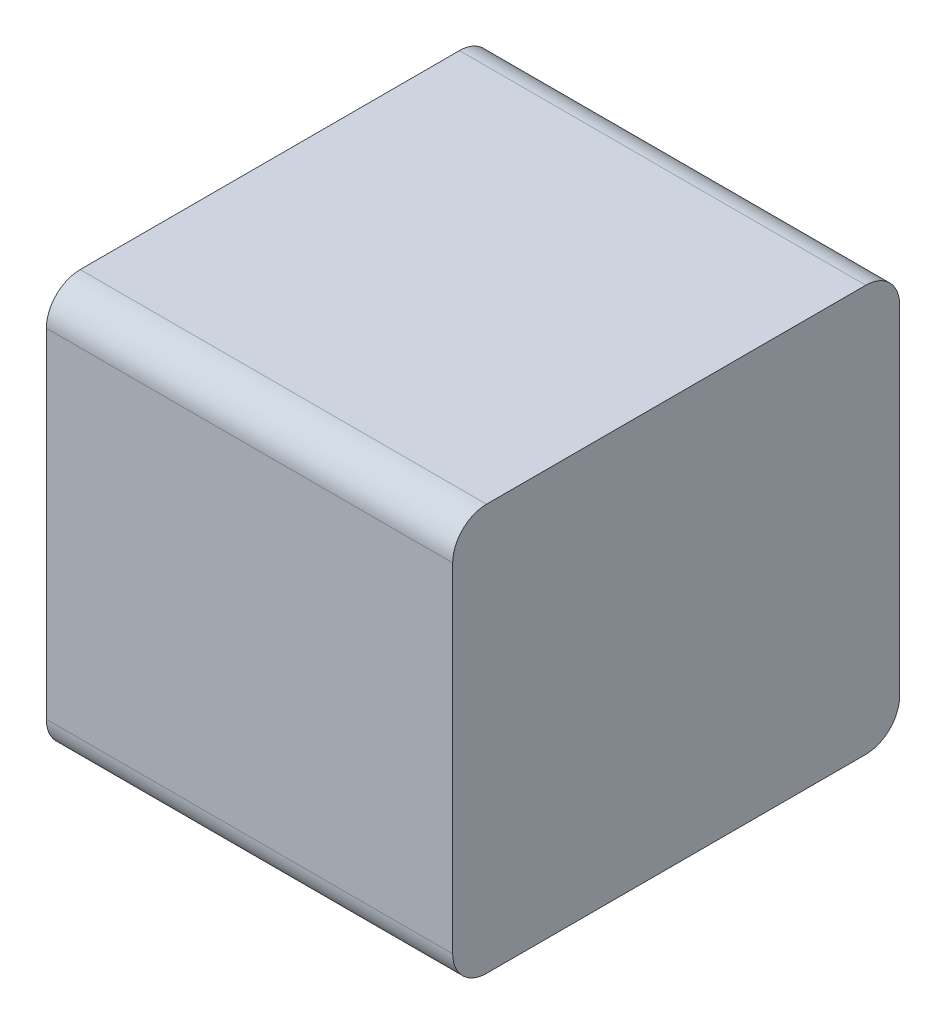
ISO-10303-21;
HEADER;
FILE_DESCRIPTION(('STEP AP214'),'2;1');
FILE_NAME('part.step','',(''),(''),'','','');
FILE_SCHEMA(('AUTOMOTIVE_DESIGN { 1 0 10303 214 1 1 1 1 }'));
ENDSEC;
DATA;
#1=APPLICATION_CONTEXT('core data for automotive mechanical design processes');
#2=APPLICATION_PROTOCOL_DEFINITION('international standard','automotive_design',2000,#1);
#3=PRODUCT_CONTEXT('',#1,'mechanical');
#4=PRODUCT('Part','Part','',(#3));
#5=PRODUCT_RELATED_PRODUCT_CATEGORY('part','',(#4));
#6=PRODUCT_DEFINITION_FORMATION('','',#4);
#7=PRODUCT_DEFINITION_CONTEXT('part definition',#1,'design');
#8=PRODUCT_DEFINITION('design','',#6,#7);
#9=PRODUCT_DEFINITION_SHAPE('','',#8);
#10=(LENGTH_UNIT() NAMED_UNIT(*) SI_UNIT(.MILLI.,.METRE.));
#11=(NAMED_UNIT(*) PLANE_ANGLE_UNIT() SI_UNIT($,.RADIAN.));
#12=(NAMED_UNIT(*) SI_UNIT($,.STERADIAN.) SOLID_ANGLE_UNIT());
#13=UNCERTAINTY_MEASURE_WITH_UNIT(LENGTH_MEASURE(1.E-05),#10,'distance_accuracy_value','');
#14=(GEOMETRIC_REPRESENTATION_CONTEXT(3) GLOBAL_UNCERTAINTY_ASSIGNED_CONTEXT((#13)) GLOBAL_UNIT_ASSIGNED_CONTEXT((#10,
#11,#12)) REPRESENTATION_CONTEXT('',''));
#15=CARTESIAN_POINT('',(0.,0.,0.));
#16=DIRECTION('',(0.,0.,1.));
#17=DIRECTION('',(1.,0.,0.));
#18=AXIS2_PLACEMENT_3D('',#15,#16,#17);
#19=CARTESIAN_POINT('',(0.15,0.,0.165));
#20=DIRECTION('',(1.,0.,0.));
#21=DIRECTION('',(0.,0.,-1.));
#22=AXIS2_PLACEMENT_3D('',#19,#20,#21);
#23=PLANE('',#22);
#24=CARTESIAN_POINT('',(0.15,-0.125,0.025));
#25=DIRECTION('',(1.,0.,0.));
#26=DIRECTION('',(0.,-1.,0.));
#27=AXIS2_PLACEMENT_3D('',#24,#25,#26);
#28=CIRCLE('',#27,0.025);
#29=CARTESIAN_POINT('',(0.15,-0.15,0.025));
#30=VERTEX_POINT('',#29);
#31=CARTESIAN_POINT('',(0.15,-0.125,0.));
#32=VERTEX_POINT('',#31);
#33=EDGE_CURVE('E11',#30,#32,#28,.T.);
#34=ORIENTED_EDGE('',*,*,#33,.T.);
#35=DIRECTION('',(0.,1.,0.));
#36=VECTOR('',#35,1.);
#37=CARTESIAN_POINT('',(0.15,-0.125,0.));
#38=LINE('',#37,#36);
#39=CARTESIAN_POINT('',(0.15,0.125,0.));
#40=VERTEX_POINT('',#39);
#41=EDGE_CURVE('E24',#32,#40,#38,.T.);
#42=ORIENTED_EDGE('',*,*,#41,.T.);
#43=CARTESIAN_POINT('',(0.15,0.125,0.025));
#44=DIRECTION('',(1.,0.,0.));
#45=DIRECTION('',(0.,0.,-1.));
#46=AXIS2_PLACEMENT_3D('',#43,#44,#45);
#47=CIRCLE('',#46,0.025);
#48=CARTESIAN_POINT('',(0.15,0.15,0.025));
#49=VERTEX_POINT('',#48);
#50=EDGE_CURVE('E141',#40,#49,#47,.T.);
#51=ORIENTED_EDGE('',*,*,#50,.T.);
#52=DIRECTION('',(0.,0.,1.));
#53=VECTOR('',#52,1.);
#54=CARTESIAN_POINT('',(0.15,0.15,0.025));
#55=LINE('',#54,#53);
#56=CARTESIAN_POINT('',(0.15,0.15,0.305));
#57=VERTEX_POINT('',#56);
#58=EDGE_CURVE('E139',#49,#57,#55,.T.);
#59=ORIENTED_EDGE('',*,*,#58,.T.);
#60=CARTESIAN_POINT('',(0.15,0.125,0.305));
#61=DIRECTION('',(1.,0.,0.));
#62=DIRECTION('',(0.,1.,0.));
#63=AXIS2_PLACEMENT_3D('',#60,#61,#62);
#64=CIRCLE('',#63,0.025);
#65=CARTESIAN_POINT('',(0.15,0.125,0.33));
#66=VERTEX_POINT('',#65);
#67=EDGE_CURVE('E137',#57,#66,#64,.T.);
#68=ORIENTED_EDGE('',*,*,#67,.T.);
#69=DIRECTION('',(0.,-1.,0.));
#70=VECTOR('',#69,1.);
#71=CARTESIAN_POINT('',(0.15,0.125,0.33));
#72=LINE('',#71,#70);
#73=CARTESIAN_POINT('',(0.15,-0.125,0.33));
#74=VERTEX_POINT('',#73);
#75=EDGE_CURVE('E135',#66,#74,#72,.T.);
#76=ORIENTED_EDGE('',*,*,#75,.T.);
#77=CARTESIAN_POINT('',(0.15,-0.125,0.305));
#78=DIRECTION('',(1.,0.,0.));
#79=DIRECTION('',(0.,0.,1.));
#80=AXIS2_PLACEMENT_3D('',#77,#78,#79);
#81=CIRCLE('',#80,0.025);
#82=CARTESIAN_POINT('',(0.15,-0.15,0.305));
#83=VERTEX_POINT('',#82);
#84=EDGE_CURVE('E133',#74,#83,#81,.T.);
#85=ORIENTED_EDGE('',*,*,#84,.T.);
#86=DIRECTION('',(0.,0.,-1.));
#87=VECTOR('',#86,1.);
#88=CARTESIAN_POINT('',(0.15,-0.15,0.305));
#89=LINE('',#88,#87);
#90=EDGE_CURVE('E131',#83,#30,#89,.T.);
#91=ORIENTED_EDGE('',*,*,#90,.T.);
#92=EDGE_LOOP('',(#34,#42,#51,#59,#68,#76,#85,#91));
#93=FACE_BOUND('',#92,.T.);
#94=ADVANCED_FACE('F17',(#93),#23,.T.);
#95=CARTESIAN_POINT('',(0.,0.125,0.));
#96=DIRECTION('',(0.,0.,-1.));
#97=DIRECTION('',(0.,-1.,0.));
#98=AXIS2_PLACEMENT_3D('',#95,#96,#97);
#99=PLANE('',#98);
#100=DIRECTION('',(1.,0.,0.));
#101=VECTOR('',#100,1.);
#102=CARTESIAN_POINT('',(0.,-0.125,0.));
#103=LINE('',#102,#101);
#104=CARTESIAN_POINT('',(-0.15,-0.125,0.));
#105=VERTEX_POINT('',#104);
#106=EDGE_CURVE('E129',#105,#32,#103,.T.);
#107=ORIENTED_EDGE('',*,*,#106,.F.);
#108=DIRECTION('',(0.,-1.,0.));
#109=VECTOR('',#108,1.);
#110=CARTESIAN_POINT('',(-0.15,-0.125,0.));
#111=LINE('',#110,#109);
#112=CARTESIAN_POINT('',(-0.15,0.125,0.));
#113=VERTEX_POINT('',#112);
#114=EDGE_CURVE('E96',#113,#105,#111,.T.);
#115=ORIENTED_EDGE('',*,*,#114,.F.);
#116=DIRECTION('',(1.,0.,0.));
#117=VECTOR('',#116,1.);
#118=CARTESIAN_POINT('',(0.,0.125,0.));
#119=LINE('',#118,#117);
#120=EDGE_CURVE('E125',#113,#40,#119,.T.);
#121=ORIENTED_EDGE('',*,*,#120,.T.);
#122=ORIENTED_EDGE('',*,*,#41,.F.);
#123=EDGE_LOOP('',(#107,#115,#121,#122));
#124=FACE_BOUND('',#123,.T.);
#125=ADVANCED_FACE('F149',(#124),#99,.T.);
#126=CARTESIAN_POINT('',(0.,0.125,0.025));
#127=DIRECTION('',(-1.,0.,0.));
#128=DIRECTION('',(0.,0.,-1.));
#129=AXIS2_PLACEMENT_3D('',#126,#127,#128);
#130=CYLINDRICAL_SURFACE('',#129,0.025);
#131=ORIENTED_EDGE('',*,*,#120,.F.);
#132=CARTESIAN_POINT('',(-0.15,0.125,0.025));
#133=DIRECTION('',(-1.,0.,0.));
#134=DIRECTION('',(0.,0.,-1.));
#135=AXIS2_PLACEMENT_3D('',#132,#133,#134);
#136=CIRCLE('',#135,0.025);
#137=CARTESIAN_POINT('',(-0.15,0.15,0.025));
#138=VERTEX_POINT('',#137);
#139=EDGE_CURVE('E123',#138,#113,#136,.T.);
#140=ORIENTED_EDGE('',*,*,#139,.F.);
#141=DIRECTION('',(1.,0.,0.));
#142=VECTOR('',#141,1.);
#143=CARTESIAN_POINT('',(0.,0.15,0.025));
#144=LINE('',#143,#142);
#145=EDGE_CURVE('E120',#138,#49,#144,.T.);
#146=ORIENTED_EDGE('',*,*,#145,.T.);
#147=ORIENTED_EDGE('',*,*,#50,.F.);
#148=EDGE_LOOP('',(#131,#140,#146,#147));
#149=FACE_BOUND('',#148,.T.);
#150=ADVANCED_FACE('F147',(#149),#130,.T.);
#151=CARTESIAN_POINT('',(0.,0.15,0.305));
#152=DIRECTION('',(0.,1.,0.));
#153=DIRECTION('',(0.,0.,-1.));
#154=AXIS2_PLACEMENT_3D('',#151,#152,#153);
#155=PLANE('',#154);
#156=ORIENTED_EDGE('',*,*,#145,.F.);
#157=DIRECTION('',(0.,0.,-1.));
#158=VECTOR('',#157,1.);
#159=CARTESIAN_POINT('',(-0.15,0.15,0.025));
#160=LINE('',#159,#158);
#161=CARTESIAN_POINT('',(-0.15,0.15,0.305));
#162=VERTEX_POINT('',#161);
#163=EDGE_CURVE('E117',#162,#138,#160,.T.);
#164=ORIENTED_EDGE('',*,*,#163,.F.);
#165=DIRECTION('',(1.,0.,0.));
#166=VECTOR('',#165,1.);
#167=CARTESIAN_POINT('',(0.,0.15,0.305));
#168=LINE('',#167,#166);
#169=EDGE_CURVE('E114',#162,#57,#168,.T.);
#170=ORIENTED_EDGE('',*,*,#169,.T.);
#171=ORIENTED_EDGE('',*,*,#58,.F.);
#172=EDGE_LOOP('',(#156,#164,#170,#171));
#173=FACE_BOUND('',#172,.T.);
#174=ADVANCED_FACE('F156',(#173),#155,.T.);
#175=CARTESIAN_POINT('',(0.,0.125,0.305));
#176=DIRECTION('',(-1.,0.,0.));
#177=DIRECTION('',(0.,1.,0.));
#178=AXIS2_PLACEMENT_3D('',#175,#176,#177);
#179=CYLINDRICAL_SURFACE('',#178,0.025);
#180=ORIENTED_EDGE('',*,*,#169,.F.);
#181=CARTESIAN_POINT('',(-0.15,0.125,0.305));
#182=DIRECTION('',(-1.,0.,0.));
#183=DIRECTION('',(0.,1.,0.));
#184=AXIS2_PLACEMENT_3D('',#181,#182,#183);
#185=CIRCLE('',#184,0.025);
#186=CARTESIAN_POINT('',(-0.15,0.125,0.33));
#187=VERTEX_POINT('',#186);
#188=EDGE_CURVE('E111',#187,#162,#185,.T.);
#189=ORIENTED_EDGE('',*,*,#188,.F.);
#190=DIRECTION('',(1.,0.,0.));
#191=VECTOR('',#190,1.);
#192=CARTESIAN_POINT('',(0.,0.125,0.33));
#193=LINE('',#192,#191);
#194=EDGE_CURVE('E108',#187,#66,#193,.T.);
#195=ORIENTED_EDGE('',*,*,#194,.T.);
#196=ORIENTED_EDGE('',*,*,#67,.F.);
#197=EDGE_LOOP('',(#180,#189,#195,#196));
#198=FACE_BOUND('',#197,.T.);
#199=ADVANCED_FACE('F161',(#198),#179,.T.);
#200=CARTESIAN_POINT('',(0.,-0.125,0.33));
#201=DIRECTION('',(0.,0.,1.));
#202=DIRECTION('',(0.,1.,0.));
#203=AXIS2_PLACEMENT_3D('',#200,#201,#202);
#204=PLANE('',#203);
#205=ORIENTED_EDGE('',*,*,#194,.F.);
#206=DIRECTION('',(0.,1.,0.));
#207=VECTOR('',#206,1.);
#208=CARTESIAN_POINT('',(-0.15,0.125,0.33));
#209=LINE('',#208,#207);
#210=CARTESIAN_POINT('',(-0.15,-0.125,0.33));
#211=VERTEX_POINT('',#210);
#212=EDGE_CURVE('E105',#211,#187,#209,.T.);
#213=ORIENTED_EDGE('',*,*,#212,.F.);
#214=DIRECTION('',(1.,0.,0.));
#215=VECTOR('',#214,1.);
#216=CARTESIAN_POINT('',(0.,-0.125,0.33));
#217=LINE('',#216,#215);
#218=EDGE_CURVE('E102',#211,#74,#217,.T.);
#219=ORIENTED_EDGE('',*,*,#218,.T.);
#220=ORIENTED_EDGE('',*,*,#75,.F.);
#221=EDGE_LOOP('',(#205,#213,#219,#220));
#222=FACE_BOUND('',#221,.T.);
#223=ADVANCED_FACE('F165',(#222),#204,.T.);
#224=CARTESIAN_POINT('',(0.,-0.125,0.305));
#225=DIRECTION('',(-1.,0.,0.));
#226=DIRECTION('',(0.,0.,1.));
#227=AXIS2_PLACEMENT_3D('',#224,#225,#226);
#228=CYLINDRICAL_SURFACE('',#227,0.025);
#229=ORIENTED_EDGE('',*,*,#218,.F.);
#230=CARTESIAN_POINT('',(-0.15,-0.125,0.305));
#231=DIRECTION('',(-1.,0.,0.));
#232=DIRECTION('',(0.,0.,1.));
#233=AXIS2_PLACEMENT_3D('',#230,#231,#232);
#234=CIRCLE('',#233,0.025);
#235=CARTESIAN_POINT('',(-0.15,-0.15,0.305));
#236=VERTEX_POINT('',#235);
#237=EDGE_CURVE('E100',#236,#211,#234,.T.);
#238=ORIENTED_EDGE('',*,*,#237,.F.);
#239=DIRECTION('',(1.,0.,0.));
#240=VECTOR('',#239,1.);
#241=CARTESIAN_POINT('',(0.,-0.15,0.305));
#242=LINE('',#241,#240);
#243=EDGE_CURVE('E84',#236,#83,#242,.T.);
#244=ORIENTED_EDGE('',*,*,#243,.T.);
#245=ORIENTED_EDGE('',*,*,#84,.F.);
#246=EDGE_LOOP('',(#229,#238,#244,#245));
#247=FACE_BOUND('',#246,.T.);
#248=ADVANCED_FACE('F169',(#247),#228,.T.);
#249=CARTESIAN_POINT('',(0.,-0.15,0.025));
#250=DIRECTION('',(0.,-1.,0.));
#251=DIRECTION('',(0.,0.,1.));
#252=AXIS2_PLACEMENT_3D('',#249,#250,#251);
#253=PLANE('',#252);
#254=ORIENTED_EDGE('',*,*,#243,.F.);
#255=DIRECTION('',(0.,0.,1.));
#256=VECTOR('',#255,1.);
#257=CARTESIAN_POINT('',(-0.15,-0.15,0.305));
#258=LINE('',#257,#256);
#259=CARTESIAN_POINT('',(-0.15,-0.15,0.025));
#260=VERTEX_POINT('',#259);
#261=EDGE_CURVE('E79',#260,#236,#258,.T.);
#262=ORIENTED_EDGE('',*,*,#261,.F.);
#263=DIRECTION('',(-1.,0.,0.));
#264=VECTOR('',#263,1.);
#265=CARTESIAN_POINT('',(0.,-0.15,0.025));
#266=LINE('',#265,#264);
#267=EDGE_CURVE('E82',#30,#260,#266,.T.);
#268=ORIENTED_EDGE('',*,*,#267,.F.);
#269=ORIENTED_EDGE('',*,*,#90,.F.);
#270=EDGE_LOOP('',(#254,#262,#268,#269));
#271=FACE_BOUND('',#270,.T.);
#272=ADVANCED_FACE('F80',(#271),#253,.T.);
#273=CARTESIAN_POINT('',(0.,-0.125,0.025));
#274=DIRECTION('',(-1.,0.,0.));
#275=DIRECTION('',(0.,-1.,0.));
#276=AXIS2_PLACEMENT_3D('',#273,#274,#275);
#277=CYLINDRICAL_SURFACE('',#276,0.025);
#278=ORIENTED_EDGE('',*,*,#267,.T.);
#279=CARTESIAN_POINT('',(-0.15,-0.125,0.025));
#280=DIRECTION('',(-1.,0.,0.));
#281=DIRECTION('',(0.,-1.,0.));
#282=AXIS2_PLACEMENT_3D('',#279,#280,#281);
#283=CIRCLE('',#282,0.025);
#284=EDGE_CURVE('E91',#105,#260,#283,.T.);
#285=ORIENTED_EDGE('',*,*,#284,.F.);
#286=ORIENTED_EDGE('',*,*,#106,.T.);
#287=ORIENTED_EDGE('',*,*,#33,.F.);
#288=EDGE_LOOP('',(#278,#285,#286,#287));
#289=FACE_BOUND('',#288,.T.);
#290=ADVANCED_FACE('F90',(#289),#277,.T.);
#291=CARTESIAN_POINT('',(-0.15,0.,0.165));
#292=DIRECTION('',(1.,0.,0.));
#293=DIRECTION('',(0.,0.,-1.));
#294=AXIS2_PLACEMENT_3D('',#291,#292,#293);
#295=PLANE('',#294);
#296=ORIENTED_EDGE('',*,*,#284,.T.);
#297=ORIENTED_EDGE('',*,*,#261,.T.);
#298=ORIENTED_EDGE('',*,*,#237,.T.);
#299=ORIENTED_EDGE('',*,*,#212,.T.);
#300=ORIENTED_EDGE('',*,*,#188,.T.);
#301=ORIENTED_EDGE('',*,*,#163,.T.);
#302=ORIENTED_EDGE('',*,*,#139,.T.);
#303=ORIENTED_EDGE('',*,*,#114,.T.);
#304=EDGE_LOOP('',(#296,#297,#298,#299,#300,#301,#302,#303));
#305=FACE_BOUND('',#304,.T.);
#306=ADVANCED_FACE('F94',(#305),#295,.F.);
#307=CLOSED_SHELL('',(#94,#125,#150,#174,#199,#223,#248,#272,#290,#306));
#308=MANIFOLD_SOLID_BREP('B1',#307);
#309=ADVANCED_BREP_SHAPE_REPRESENTATION('',(#18,#308),#14);
#310=SHAPE_DEFINITION_REPRESENTATION(#9,#309);
ENDSEC;
END-ISO-10303-21;
